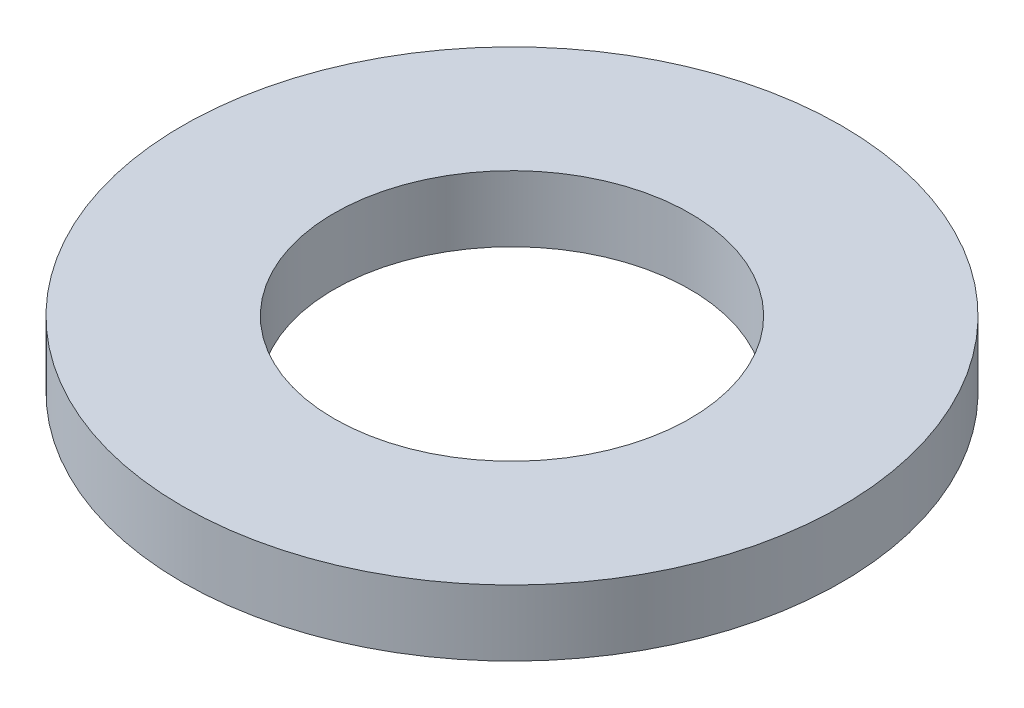
ISO-10303-21;
HEADER;
FILE_DESCRIPTION(('STEP AP214'),'2;1');
FILE_NAME('part.step','',(''),(''),'','','');
FILE_SCHEMA(('AUTOMOTIVE_DESIGN { 1 0 10303 214 1 1 1 1 }'));
ENDSEC;
DATA;
#1=APPLICATION_CONTEXT('core data for automotive mechanical design processes');
#2=APPLICATION_PROTOCOL_DEFINITION('international standard','automotive_design',2000,#1);
#3=PRODUCT_CONTEXT('',#1,'mechanical');
#4=PRODUCT('Part','Part','',(#3));
#5=PRODUCT_RELATED_PRODUCT_CATEGORY('part','',(#4));
#6=PRODUCT_DEFINITION_FORMATION('','',#4);
#7=PRODUCT_DEFINITION_CONTEXT('part definition',#1,'design');
#8=PRODUCT_DEFINITION('design','',#6,#7);
#9=PRODUCT_DEFINITION_SHAPE('','',#8);
#10=(LENGTH_UNIT() NAMED_UNIT(*) SI_UNIT(.MILLI.,.METRE.));
#11=(NAMED_UNIT(*) PLANE_ANGLE_UNIT() SI_UNIT($,.RADIAN.));
#12=(NAMED_UNIT(*) SI_UNIT($,.STERADIAN.) SOLID_ANGLE_UNIT());
#13=UNCERTAINTY_MEASURE_WITH_UNIT(LENGTH_MEASURE(1.E-05),#10,'distance_accuracy_value','');
#14=(GEOMETRIC_REPRESENTATION_CONTEXT(3) GLOBAL_UNCERTAINTY_ASSIGNED_CONTEXT((#13)) GLOBAL_UNIT_ASSIGNED_CONTEXT((#10,
#11,#12)) REPRESENTATION_CONTEXT('',''));
#15=CARTESIAN_POINT('',(0.,0.,0.));
#16=DIRECTION('',(0.,0.,1.));
#17=DIRECTION('',(1.,0.,0.));
#18=AXIS2_PLACEMENT_3D('',#15,#16,#17);
#19=CARTESIAN_POINT('',(0.,-1.,-350.));
#20=DIRECTION('',(0.,1.,0.));
#21=DIRECTION('',(0.,0.,1.));
#22=AXIS2_PLACEMENT_3D('',#19,#20,#21);
#23=PLANE('',#22);
#24=CARTESIAN_POINT('',(0.,-1.,-350.));
#25=DIRECTION('',(0.,1.,0.));
#26=DIRECTION('',(0.,0.,1.));
#27=AXIS2_PLACEMENT_3D('',#24,#25,#26);
#28=CIRCLE('',#27,2.7);
#29=CARTESIAN_POINT('',(0.,-1.,-347.3));
#30=VERTEX_POINT('',#29);
#31=EDGE_CURVE('E27',#30,#30,#28,.T.);
#32=ORIENTED_EDGE('',*,*,#31,.T.);
#33=EDGE_LOOP('',(#32));
#34=FACE_BOUND('',#33,.T.);
#35=CARTESIAN_POINT('',(0.,-1.,-350.));
#36=DIRECTION('',(0.,1.,0.));
#37=DIRECTION('',(0.,0.,1.));
#38=AXIS2_PLACEMENT_3D('',#35,#36,#37);
#39=CIRCLE('',#38,4.99999999999999);
#40=CARTESIAN_POINT('',(0.,-1.,-345.));
#41=VERTEX_POINT('',#40);
#42=EDGE_CURVE('E18',#41,#41,#39,.T.);
#43=ORIENTED_EDGE('',*,*,#42,.F.);
#44=EDGE_LOOP('',(#43));
#45=FACE_BOUND('',#44,.T.);
#46=ADVANCED_FACE('F15',(#34,#45),#23,.F.);
#47=CARTESIAN_POINT('',(0.,0.,-350.));
#48=DIRECTION('',(0.,1.,0.));
#49=DIRECTION('',(0.,0.,1.));
#50=AXIS2_PLACEMENT_3D('',#47,#48,#49);
#51=CYLINDRICAL_SURFACE('',#50,4.99999999999999);
#52=CARTESIAN_POINT('',(0.,0.,-350.));
#53=DIRECTION('',(0.,1.,0.));
#54=DIRECTION('',(0.,0.,1.));
#55=AXIS2_PLACEMENT_3D('',#52,#53,#54);
#56=CIRCLE('',#55,4.99999999999999);
#57=CARTESIAN_POINT('',(0.,0.,-345.));
#58=VERTEX_POINT('',#57);
#59=EDGE_CURVE('E22',#58,#58,#56,.T.);
#60=ORIENTED_EDGE('',*,*,#59,.F.);
#61=EDGE_LOOP('',(#60));
#62=FACE_BOUND('',#61,.T.);
#63=ORIENTED_EDGE('',*,*,#42,.T.);
#64=EDGE_LOOP('',(#63));
#65=FACE_BOUND('',#64,.T.);
#66=ADVANCED_FACE('F35',(#62,#65),#51,.T.);
#67=CARTESIAN_POINT('',(0.,0.,-350.));
#68=DIRECTION('',(0.,1.,0.));
#69=DIRECTION('',(0.,0.,1.));
#70=AXIS2_PLACEMENT_3D('',#67,#68,#69);
#71=CYLINDRICAL_SURFACE('',#70,2.7);
#72=CARTESIAN_POINT('',(0.,0.,-350.));
#73=DIRECTION('',(0.,1.,0.));
#74=DIRECTION('',(0.,0.,1.));
#75=AXIS2_PLACEMENT_3D('',#72,#73,#74);
#76=CIRCLE('',#75,2.7);
#77=CARTESIAN_POINT('',(0.,0.,-347.3));
#78=VERTEX_POINT('',#77);
#79=EDGE_CURVE('E10',#78,#78,#76,.F.);
#80=ORIENTED_EDGE('',*,*,#79,.F.);
#81=EDGE_LOOP('',(#80));
#82=FACE_BOUND('',#81,.T.);
#83=ORIENTED_EDGE('',*,*,#31,.F.);
#84=EDGE_LOOP('',(#83));
#85=FACE_BOUND('',#84,.T.);
#86=ADVANCED_FACE('F42',(#82,#85),#71,.F.);
#87=CARTESIAN_POINT('',(0.,0.,-350.));
#88=DIRECTION('',(0.,1.,0.));
#89=DIRECTION('',(0.,0.,1.));
#90=AXIS2_PLACEMENT_3D('',#87,#88,#89);
#91=PLANE('',#90);
#92=ORIENTED_EDGE('',*,*,#79,.T.);
#93=EDGE_LOOP('',(#92));
#94=FACE_BOUND('',#93,.T.);
#95=ORIENTED_EDGE('',*,*,#59,.T.);
#96=EDGE_LOOP('',(#95));
#97=FACE_BOUND('',#96,.T.);
#98=ADVANCED_FACE('F44',(#94,#97),#91,.T.);
#99=CLOSED_SHELL('',(#46,#66,#86,#98));
#100=MANIFOLD_SOLID_BREP('B1',#99);
#101=ADVANCED_BREP_SHAPE_REPRESENTATION('',(#18,#100),#14);
#102=SHAPE_DEFINITION_REPRESENTATION(#9,#101);
ENDSEC;
END-ISO-10303-21;
